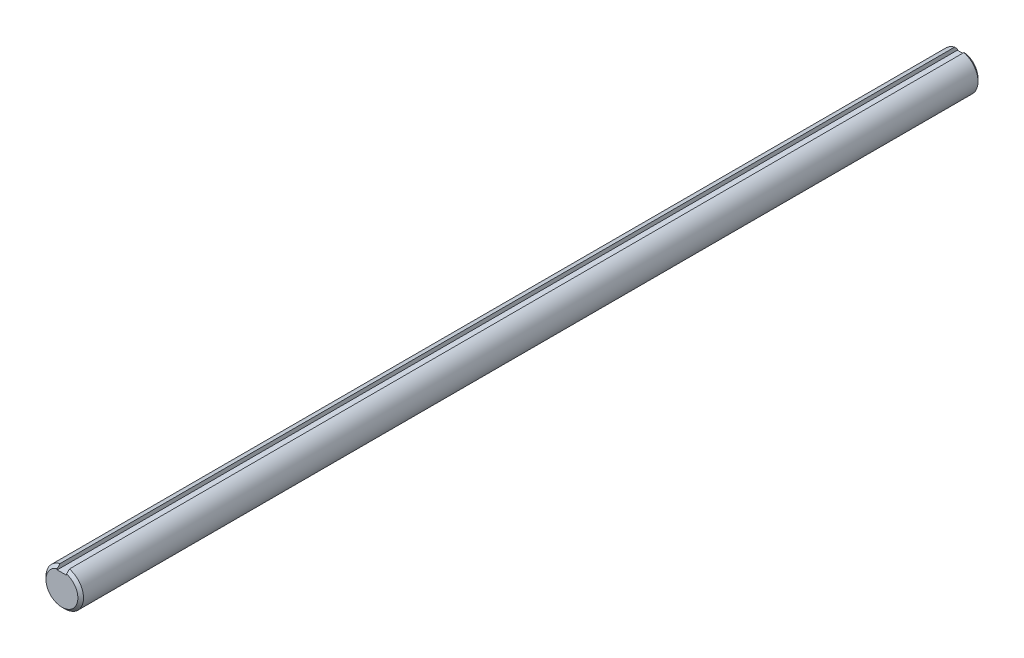
ISO-10303-21;
HEADER;
FILE_DESCRIPTION(('STEP AP214'),'2;1');
FILE_NAME('part.step','',(''),(''),'','','');
FILE_SCHEMA(('AUTOMOTIVE_DESIGN { 1 0 10303 214 1 1 1 1 }'));
ENDSEC;
DATA;
#1=APPLICATION_CONTEXT('core data for automotive mechanical design processes');
#2=APPLICATION_PROTOCOL_DEFINITION('international standard','automotive_design',2000,#1);
#3=PRODUCT_CONTEXT('',#1,'mechanical');
#4=PRODUCT('Part','Part','',(#3));
#5=PRODUCT_RELATED_PRODUCT_CATEGORY('part','',(#4));
#6=PRODUCT_DEFINITION_FORMATION('','',#4);
#7=PRODUCT_DEFINITION_CONTEXT('part definition',#1,'design');
#8=PRODUCT_DEFINITION('design','',#6,#7);
#9=PRODUCT_DEFINITION_SHAPE('','',#8);
#10=(LENGTH_UNIT() NAMED_UNIT(*) SI_UNIT(.MILLI.,.METRE.));
#11=(NAMED_UNIT(*) PLANE_ANGLE_UNIT() SI_UNIT($,.RADIAN.));
#12=(NAMED_UNIT(*) SI_UNIT($,.STERADIAN.) SOLID_ANGLE_UNIT());
#13=UNCERTAINTY_MEASURE_WITH_UNIT(LENGTH_MEASURE(1.E-05),#10,'distance_accuracy_value','');
#14=(GEOMETRIC_REPRESENTATION_CONTEXT(3) GLOBAL_UNCERTAINTY_ASSIGNED_CONTEXT((#13)) GLOBAL_UNIT_ASSIGNED_CONTEXT((#10,
#11,#12)) REPRESENTATION_CONTEXT('',''));
#15=CARTESIAN_POINT('',(0.,0.,0.));
#16=DIRECTION('',(0.,0.,1.));
#17=DIRECTION('',(1.,0.,0.));
#18=AXIS2_PLACEMENT_3D('',#15,#16,#17);
#19=CARTESIAN_POINT('',(0.,0.,152.4));
#20=DIRECTION('',(0.,0.,-1.));
#21=DIRECTION('',(-1.,0.,0.));
#22=AXIS2_PLACEMENT_3D('',#19,#20,#21);
#23=CYLINDRICAL_SURFACE('',#22,6.35);
#24=CARTESIAN_POINT('',(0.,0.,151.4475));
#25=DIRECTION('',(0.,0.,1.));
#26=DIRECTION('',(1.,0.,0.));
#27=AXIS2_PLACEMENT_3D('',#24,#25,#26);
#28=CIRCLE('',#27,6.35);
#29=CARTESIAN_POINT('',(1.5875,6.14836106210427,151.4475));
#30=VERTEX_POINT('',#29);
#31=CARTESIAN_POINT('',(-1.5875,6.14836106210427,151.4475));
#32=VERTEX_POINT('',#31);
#33=EDGE_CURVE('E149',#30,#32,#28,.F.);
#34=ORIENTED_EDGE('',*,*,#33,.T.);
#35=DIRECTION('',(0.,0.,-1.));
#36=VECTOR('',#35,1.);
#37=CARTESIAN_POINT('',(-1.5875,6.14836106210427,152.4));
#38=LINE('',#37,#36);
#39=CARTESIAN_POINT('',(-1.5875,6.14836106210427,-151.4475));
#40=VERTEX_POINT('',#39);
#41=EDGE_CURVE('E127',#32,#40,#38,.T.);
#42=ORIENTED_EDGE('',*,*,#41,.T.);
#43=CARTESIAN_POINT('',(0.,0.,-151.4475));
#44=DIRECTION('',(0.,0.,1.));
#45=DIRECTION('',(1.,0.,0.));
#46=AXIS2_PLACEMENT_3D('',#43,#44,#45);
#47=CIRCLE('',#46,6.35);
#48=CARTESIAN_POINT('',(1.5875,6.14836106210427,-151.4475));
#49=VERTEX_POINT('',#48);
#50=EDGE_CURVE('E146',#40,#49,#47,.T.);
#51=ORIENTED_EDGE('',*,*,#50,.T.);
#52=DIRECTION('',(0.,0.,-1.));
#53=VECTOR('',#52,1.);
#54=CARTESIAN_POINT('',(1.5875,6.14836106210427,152.4));
#55=LINE('',#54,#53);
#56=EDGE_CURVE('E117',#49,#30,#55,.F.);
#57=ORIENTED_EDGE('',*,*,#56,.T.);
#58=EDGE_LOOP('',(#34,#42,#51,#57));
#59=FACE_BOUND('',#58,.T.);
#60=ADVANCED_FACE('F32',(#59),#23,.T.);
#61=CARTESIAN_POINT('',(0.,0.,152.4));
#62=DIRECTION('',(0.,0.,1.));
#63=DIRECTION('',(1.,0.,0.));
#64=AXIS2_PLACEMENT_3D('',#61,#62,#63);
#65=PLANE('',#64);
#66=DIRECTION('',(0.,-1.,0.));
#67=VECTOR('',#66,1.);
#68=CARTESIAN_POINT('',(-1.5875,6.35,152.4));
#69=LINE('',#68,#67);
#70=CARTESIAN_POINT('',(-1.5875,5.15876438694398,152.4));
#71=VERTEX_POINT('',#70);
#72=CARTESIAN_POINT('',(-1.5875,4.7625,152.4));
#73=VERTEX_POINT('',#72);
#74=EDGE_CURVE('E87',#71,#73,#69,.T.);
#75=ORIENTED_EDGE('',*,*,#74,.F.);
#76=CARTESIAN_POINT('',(0.,0.,152.4));
#77=DIRECTION('',(0.,0.,1.));
#78=DIRECTION('',(1.,0.,0.));
#79=AXIS2_PLACEMENT_3D('',#76,#77,#78);
#80=CIRCLE('',#79,5.39750000000014);
#81=CARTESIAN_POINT('',(1.5875,5.15876438694398,152.4));
#82=VERTEX_POINT('',#81);
#83=EDGE_CURVE('E141',#71,#82,#80,.T.);
#84=ORIENTED_EDGE('',*,*,#83,.T.);
#85=DIRECTION('',(0.,1.,0.));
#86=VECTOR('',#85,1.);
#87=CARTESIAN_POINT('',(1.5875,6.35,152.4));
#88=LINE('',#87,#86);
#89=CARTESIAN_POINT('',(1.5875,4.7625,152.4));
#90=VERTEX_POINT('',#89);
#91=EDGE_CURVE('E52',#90,#82,#88,.T.);
#92=ORIENTED_EDGE('',*,*,#91,.F.);
#93=DIRECTION('',(1.,0.,0.));
#94=VECTOR('',#93,1.);
#95=CARTESIAN_POINT('',(-1.5875,4.7625,152.4));
#96=LINE('',#95,#94);
#97=EDGE_CURVE('E97',#73,#90,#96,.T.);
#98=ORIENTED_EDGE('',*,*,#97,.F.);
#99=EDGE_LOOP('',(#75,#84,#92,#98));
#100=FACE_BOUND('',#99,.T.);
#101=ADVANCED_FACE('F108',(#100),#65,.T.);
#102=CARTESIAN_POINT('',(0.,0.,-152.4));
#103=DIRECTION('',(0.,0.,1.));
#104=DIRECTION('',(1.,0.,0.));
#105=AXIS2_PLACEMENT_3D('',#102,#103,#104);
#106=PLANE('',#105);
#107=CARTESIAN_POINT('',(0.,0.,-152.4));
#108=DIRECTION('',(0.,0.,1.));
#109=DIRECTION('',(1.,0.,0.));
#110=AXIS2_PLACEMENT_3D('',#107,#108,#109);
#111=CIRCLE('',#110,5.39749999999975);
#112=CARTESIAN_POINT('',(1.5875,5.15876438694357,-152.4));
#113=VERTEX_POINT('',#112);
#114=CARTESIAN_POINT('',(-1.5875,5.15876438694357,-152.4));
#115=VERTEX_POINT('',#114);
#116=EDGE_CURVE('E143',#113,#115,#111,.F.);
#117=ORIENTED_EDGE('',*,*,#116,.T.);
#118=DIRECTION('',(0.,-1.,0.));
#119=VECTOR('',#118,1.);
#120=CARTESIAN_POINT('',(-1.5875,6.35,-152.4));
#121=LINE('',#120,#119);
#122=CARTESIAN_POINT('',(-1.5875,4.7625,-152.4));
#123=VERTEX_POINT('',#122);
#124=EDGE_CURVE('E110',#115,#123,#121,.T.);
#125=ORIENTED_EDGE('',*,*,#124,.T.);
#126=DIRECTION('',(1.,0.,0.));
#127=VECTOR('',#126,1.);
#128=CARTESIAN_POINT('',(-1.5875,4.7625,-152.4));
#129=LINE('',#128,#127);
#130=CARTESIAN_POINT('',(1.5875,4.7625,-152.4));
#131=VERTEX_POINT('',#130);
#132=EDGE_CURVE('E103',#123,#131,#129,.T.);
#133=ORIENTED_EDGE('',*,*,#132,.T.);
#134=DIRECTION('',(0.,1.,0.));
#135=VECTOR('',#134,1.);
#136=CARTESIAN_POINT('',(1.5875,6.35,-152.4));
#137=LINE('',#136,#135);
#138=EDGE_CURVE('E106',#131,#113,#137,.T.);
#139=ORIENTED_EDGE('',*,*,#138,.T.);
#140=EDGE_LOOP('',(#117,#125,#133,#139));
#141=FACE_BOUND('',#140,.T.);
#142=ADVANCED_FACE('F160',(#141),#106,.F.);
#143=CARTESIAN_POINT('',(0.,0.,-151.4475));
#144=DIRECTION('',(0.,0.,1.));
#145=DIRECTION('',(1.,0.,0.));
#146=AXIS2_PLACEMENT_3D('',#143,#144,#145);
#147=CONICAL_SURFACE('',#146,6.35,0.785398163397422);
#148=CARTESIAN_POINT('',(-1.5875,2.50467512421999,-154.832107323155));
#149=CARTESIAN_POINT('',(-1.5875,2.61995748799075,-154.734670566395));
#150=CARTESIAN_POINT('',(-1.5875,2.73434819416599,-154.636194096017));
#151=CARTESIAN_POINT('',(-1.5875,2.96171067704992,-154.437631802363));
#152=CARTESIAN_POINT('',(-1.5875,3.07468256144108,-154.33754610255));
#153=CARTESIAN_POINT('',(-1.5875,3.29956921576388,-154.136238361708));
#154=CARTESIAN_POINT('',(-1.5875,3.41148417069838,-154.035016526598));
#155=CARTESIAN_POINT('',(-1.5875,3.63450717009289,-153.831683597431));
#156=CARTESIAN_POINT('',(-1.5875,3.74561519672351,-153.729572483834));
#157=CARTESIAN_POINT('',(-1.5875,4.07794041463337,-153.422275163923));
#158=CARTESIAN_POINT('',(-1.5875,4.29821694512222,-153.216072467645));
#159=CARTESIAN_POINT('',(-1.5875,4.73715914530373,-152.801942304272));
#160=CARTESIAN_POINT('',(-1.5875,4.9558247294017,-152.59401474676));
#161=CARTESIAN_POINT('',(-1.5875,5.39197585155526,-152.177048729909));
#162=CARTESIAN_POINT('',(-1.5875,5.60946170363252,-151.968010598799));
#163=CARTESIAN_POINT('',(-1.5875,6.04362892921897,-151.549111015667));
#164=CARTESIAN_POINT('',(-1.5875,6.260310320507,-151.339249582055));
#165=CARTESIAN_POINT('',(-1.5875,6.69313054205308,-150.918874652796));
#166=CARTESIAN_POINT('',(-1.5875,6.90926924461319,-150.708361025747));
#167=CARTESIAN_POINT('',(-1.5875,7.34108970538692,-150.286866537556));
#168=CARTESIAN_POINT('',(-1.5875,7.55677146466173,-150.075885677502));
#169=CARTESIAN_POINT('',(-1.5875,7.77229162734192,-149.864740493343));
#170=B_SPLINE_CURVE_WITH_KNOTS('',3,(#148,#149,#150,#151,#152,#153,#154,#155,#156,#157,#158,
#159,#160,#161,#162,#163,#164,#165,#166,#167,#168,#169),.UNSPECIFIED.,.F.,.F.,(4,2,2,2,2,2,2,2,
2,2,4),(0.,0.452810247519155,0.905585918444147,1.35828081011681,1.81098567399962,
2.7161602553464,3.6213825895488,4.52635081760605,5.43129892508652,6.3364430635279,
7.24158509760064),.UNSPECIFIED.);
#171=EDGE_CURVE('E60',#115,#40,#170,.T.);
#172=ORIENTED_EDGE('',*,*,#171,.F.);
#173=ORIENTED_EDGE('',*,*,#116,.F.);
#174=CARTESIAN_POINT('',(1.5875,7.77229162734192,-149.864740493343));
#175=CARTESIAN_POINT('',(1.5875,7.55677146466173,-150.075885677502));
#176=CARTESIAN_POINT('',(1.5875,7.34108970538692,-150.286866537556));
#177=CARTESIAN_POINT('',(1.5875,6.90926924461319,-150.708361025747));
#178=CARTESIAN_POINT('',(1.5875,6.69313054205308,-150.918874652796));
#179=CARTESIAN_POINT('',(1.5875,6.260310320507,-151.339249582055));
#180=CARTESIAN_POINT('',(1.5875,6.04362892921897,-151.549111015667));
#181=CARTESIAN_POINT('',(1.5875,5.60946170363252,-151.968010598799));
#182=CARTESIAN_POINT('',(1.5875,5.39197585155526,-152.177048729909));
#183=CARTESIAN_POINT('',(1.5875,4.95582472940171,-152.59401474676));
#184=CARTESIAN_POINT('',(1.5875,4.73715914530374,-152.801942304272));
#185=CARTESIAN_POINT('',(1.5875,4.29821694512224,-153.216072467645));
#186=CARTESIAN_POINT('',(1.5875,4.07794041463338,-153.422275163923));
#187=CARTESIAN_POINT('',(1.5875,3.74561519672354,-153.729572483834));
#188=CARTESIAN_POINT('',(1.5875,3.63450717009292,-153.831683597431));
#189=CARTESIAN_POINT('',(1.5875,3.41148417069842,-154.035016526598));
#190=CARTESIAN_POINT('',(1.5875,3.29956921576391,-154.136238361708));
#191=CARTESIAN_POINT('',(1.5875,3.0746825614411,-154.33754610255));
#192=CARTESIAN_POINT('',(1.5875,2.96171067704994,-154.437631802363));
#193=CARTESIAN_POINT('',(1.5875,2.734348194166,-154.636194096017));
#194=CARTESIAN_POINT('',(1.5875,2.61995748799076,-154.734670566395));
#195=CARTESIAN_POINT('',(1.5875,2.50467512421999,-154.832107323155));
#196=B_SPLINE_CURVE_WITH_KNOTS('',3,(#174,#175,#176,#177,#178,#179,#180,#181,#182,#183,#184,
#185,#186,#187,#188,#189,#190,#191,#192,#193,#194,#195),.UNSPECIFIED.,.F.,.F.,(4,2,2,2,2,2,2,2,
2,2,4),(0.,0.905142034072741,1.81028617251412,2.71523427999459,3.62020250805184,
4.52542484225424,5.43059942360098,5.88330428748378,6.33599917915645,6.78877485008148,
7.24158509760064),.UNSPECIFIED.);
#197=EDGE_CURVE('E121',#49,#113,#196,.T.);
#198=ORIENTED_EDGE('',*,*,#197,.F.);
#199=ORIENTED_EDGE('',*,*,#50,.F.);
#200=EDGE_LOOP('',(#172,#173,#198,#199));
#201=FACE_BOUND('',#200,.T.);
#202=ADVANCED_FACE('F129',(#201),#147,.T.);
#203=CARTESIAN_POINT('',(0.,0.,152.4));
#204=DIRECTION('',(0.,0.,-1.));
#205=DIRECTION('',(-1.,0.,0.));
#206=AXIS2_PLACEMENT_3D('',#203,#204,#205);
#207=CONICAL_SURFACE('',#206,5.39750000000014,0.785398163397437);
#208=CARTESIAN_POINT('',(-1.5875,7.7722916273419,149.864740493344));
#209=CARTESIAN_POINT('',(-1.5875,7.55677146466173,150.075885677502));
#210=CARTESIAN_POINT('',(-1.5875,7.34108970538694,150.286866537557));
#211=CARTESIAN_POINT('',(-1.5875,6.90926924461323,150.708361025748));
#212=CARTESIAN_POINT('',(-1.5875,6.69313054205313,150.918874652797));
#213=CARTESIAN_POINT('',(-1.5875,6.26031032050707,151.339249582055));
#214=CARTESIAN_POINT('',(-1.5875,6.04362892921905,151.549111015668));
#215=CARTESIAN_POINT('',(-1.5875,5.60946170363262,151.968010598799));
#216=CARTESIAN_POINT('',(-1.5875,5.39197585155537,152.17704872991));
#217=CARTESIAN_POINT('',(-1.5875,4.95582472940184,152.59401474676));
#218=CARTESIAN_POINT('',(-1.5875,4.73715914530388,152.801942304272));
#219=CARTESIAN_POINT('',(-1.5875,4.2982169451224,153.216072467645));
#220=CARTESIAN_POINT('',(-1.5875,4.07794041463355,153.422275163923));
#221=CARTESIAN_POINT('',(-1.5875,3.74561519672372,153.729572483834));
#222=CARTESIAN_POINT('',(-1.5875,3.63450717009311,153.831683597431));
#223=CARTESIAN_POINT('',(-1.5875,3.41148417069863,154.035016526598));
#224=CARTESIAN_POINT('',(-1.5875,3.29956921576412,154.136238361708));
#225=CARTESIAN_POINT('',(-1.5875,3.07468256144134,154.33754610255));
#226=CARTESIAN_POINT('',(-1.5875,2.9617106770502,154.437631802363));
#227=CARTESIAN_POINT('',(-1.5875,2.7343481941663,154.636194096017));
#228=CARTESIAN_POINT('',(-1.5875,2.61995748799106,154.734670566395));
#229=CARTESIAN_POINT('',(-1.5875,2.5046751242203,154.832107323155));
#230=B_SPLINE_CURVE_WITH_KNOTS('',3,(#208,#209,#210,#211,#212,#213,#214,#215,#216,#217,#218,
#219,#220,#221,#222,#223,#224,#225,#226,#227,#228,#229),.UNSPECIFIED.,.F.,.F.,(4,2,2,2,2,2,2,2,
2,2,4),(0.,0.905142034072672,1.81028617251399,2.7152342799944,3.62020250805159,4.52542484225395,
5.43059942360066,5.88330428748342,6.33599917915606,6.788774850081,7.24158509760012),.UNSPECIFIED.);
#231=EDGE_CURVE('E11',#32,#71,#230,.T.);
#232=ORIENTED_EDGE('',*,*,#231,.F.);
#233=ORIENTED_EDGE('',*,*,#33,.F.);
#234=CARTESIAN_POINT('',(1.5875,2.5046751242203,154.832107323155));
#235=CARTESIAN_POINT('',(1.5875,2.61995748799105,154.734670566395));
#236=CARTESIAN_POINT('',(1.5875,2.73434819416628,154.636194096017));
#237=CARTESIAN_POINT('',(1.5875,2.96171067705018,154.437631802363));
#238=CARTESIAN_POINT('',(1.5875,3.07468256144133,154.33754610255));
#239=CARTESIAN_POINT('',(1.5875,3.29956921576412,154.136238361708));
#240=CARTESIAN_POINT('',(1.5875,3.41148417069863,154.035016526598));
#241=CARTESIAN_POINT('',(1.5875,3.63450717009312,153.831683597431));
#242=CARTESIAN_POINT('',(1.5875,3.74561519672373,153.729572483834));
#243=CARTESIAN_POINT('',(1.5875,4.07794041463356,153.422275163923));
#244=CARTESIAN_POINT('',(1.5875,4.29821694512241,153.216072467645));
#245=CARTESIAN_POINT('',(1.5875,4.73715914530389,152.801942304272));
#246=CARTESIAN_POINT('',(1.5875,4.95582472940185,152.59401474676));
#247=CARTESIAN_POINT('',(1.5875,5.39197585155538,152.17704872991));
#248=CARTESIAN_POINT('',(1.5875,5.60946170363262,151.968010598799));
#249=CARTESIAN_POINT('',(1.5875,6.04362892921905,151.549111015668));
#250=CARTESIAN_POINT('',(1.5875,6.26031032050707,151.339249582055));
#251=CARTESIAN_POINT('',(1.5875,6.69313054205314,150.918874652797));
#252=CARTESIAN_POINT('',(1.5875,6.90926924461323,150.708361025748));
#253=CARTESIAN_POINT('',(1.5875,7.34108970538694,150.286866537557));
#254=CARTESIAN_POINT('',(1.5875,7.55677146466173,150.075885677502));
#255=CARTESIAN_POINT('',(1.5875,7.7722916273419,149.864740493344));
#256=B_SPLINE_CURVE_WITH_KNOTS('',3,(#234,#235,#236,#237,#238,#239,#240,#241,#242,#243,#244,
#245,#246,#247,#248,#249,#250,#251,#252,#253,#254,#255),.UNSPECIFIED.,.F.,.F.,(4,2,2,2,2,2,2,2,
2,2,4),(0.,0.452810247519086,0.905585918444067,1.3582808101167,1.81098567399947,
2.71616025534621,3.62138258954854,4.52635081760572,5.43129892508614,6.33644306352745,
7.24158509760012),.UNSPECIFIED.);
#257=EDGE_CURVE('E45',#82,#30,#256,.T.);
#258=ORIENTED_EDGE('',*,*,#257,.F.);
#259=ORIENTED_EDGE('',*,*,#83,.F.);
#260=EDGE_LOOP('',(#232,#233,#258,#259));
#261=FACE_BOUND('',#260,.T.);
#262=ADVANCED_FACE('F34',(#261),#207,.T.);
#263=CARTESIAN_POINT('',(-1.5875,6.35,-152.4));
#264=DIRECTION('',(-1.,0.,0.));
#265=DIRECTION('',(0.,0.,1.));
#266=AXIS2_PLACEMENT_3D('',#263,#264,#265);
#267=PLANE('',#266);
#268=ORIENTED_EDGE('',*,*,#171,.T.);
#269=ORIENTED_EDGE('',*,*,#41,.F.);
#270=ORIENTED_EDGE('',*,*,#231,.T.);
#271=ORIENTED_EDGE('',*,*,#74,.T.);
#272=DIRECTION('',(0.,0.,1.));
#273=VECTOR('',#272,1.);
#274=CARTESIAN_POINT('',(-1.5875,4.7625,-152.4));
#275=LINE('',#274,#273);
#276=EDGE_CURVE('E90',#123,#73,#275,.T.);
#277=ORIENTED_EDGE('',*,*,#276,.F.);
#278=ORIENTED_EDGE('',*,*,#124,.F.);
#279=EDGE_LOOP('',(#268,#269,#270,#271,#277,#278));
#280=FACE_BOUND('',#279,.T.);
#281=ADVANCED_FACE('F89',(#280),#267,.F.);
#282=CARTESIAN_POINT('',(1.5875,6.35,-152.4));
#283=DIRECTION('',(1.,0.,0.));
#284=DIRECTION('',(0.,0.,-1.));
#285=AXIS2_PLACEMENT_3D('',#282,#283,#284);
#286=PLANE('',#285);
#287=ORIENTED_EDGE('',*,*,#197,.T.);
#288=ORIENTED_EDGE('',*,*,#138,.F.);
#289=DIRECTION('',(0.,0.,1.));
#290=VECTOR('',#289,1.);
#291=CARTESIAN_POINT('',(1.5875,4.7625,-152.4));
#292=LINE('',#291,#290);
#293=EDGE_CURVE('E105',#131,#90,#292,.T.);
#294=ORIENTED_EDGE('',*,*,#293,.T.);
#295=ORIENTED_EDGE('',*,*,#91,.T.);
#296=ORIENTED_EDGE('',*,*,#257,.T.);
#297=ORIENTED_EDGE('',*,*,#56,.F.);
#298=EDGE_LOOP('',(#287,#288,#294,#295,#296,#297));
#299=FACE_BOUND('',#298,.T.);
#300=ADVANCED_FACE('F132',(#299),#286,.F.);
#301=CARTESIAN_POINT('',(-1.5875,4.7625,-152.4));
#302=DIRECTION('',(0.,-1.,0.));
#303=DIRECTION('',(0.,0.,-1.));
#304=AXIS2_PLACEMENT_3D('',#301,#302,#303);
#305=PLANE('',#304);
#306=ORIENTED_EDGE('',*,*,#293,.F.);
#307=ORIENTED_EDGE('',*,*,#132,.F.);
#308=ORIENTED_EDGE('',*,*,#276,.T.);
#309=ORIENTED_EDGE('',*,*,#97,.T.);
#310=EDGE_LOOP('',(#306,#307,#308,#309));
#311=FACE_BOUND('',#310,.T.);
#312=ADVANCED_FACE('F101',(#311),#305,.F.);
#313=CLOSED_SHELL('',(#60,#101,#142,#202,#262,#281,#300,#312));
#314=MANIFOLD_SOLID_BREP('B2',#313);
#315=ADVANCED_BREP_SHAPE_REPRESENTATION('',(#18,#314),#14);
#316=SHAPE_DEFINITION_REPRESENTATION(#9,#315);
ENDSEC;
END-ISO-10303-21;
